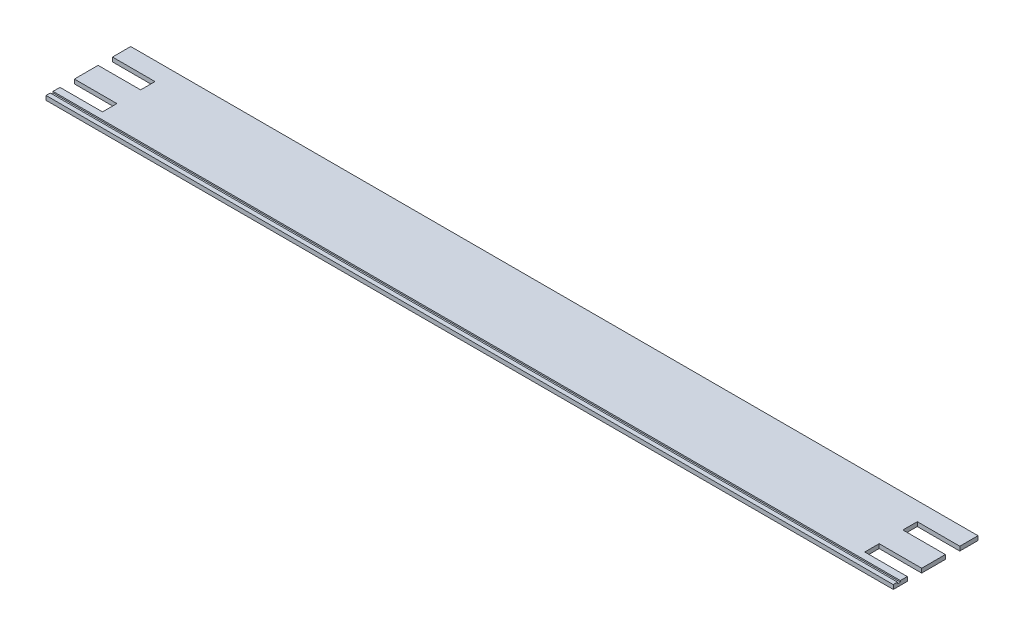
ISO-10303-21;
HEADER;
FILE_DESCRIPTION(('STEP AP214'),'2;1');
FILE_NAME('part.step','',(''),(''),'','','');
FILE_SCHEMA(('AUTOMOTIVE_DESIGN { 1 0 10303 214 1 1 1 1 }'));
ENDSEC;
DATA;
#1=APPLICATION_CONTEXT('core data for automotive mechanical design processes');
#2=APPLICATION_PROTOCOL_DEFINITION('international standard','automotive_design',2000,#1);
#3=PRODUCT_CONTEXT('',#1,'mechanical');
#4=PRODUCT('Part','Part','',(#3));
#5=PRODUCT_RELATED_PRODUCT_CATEGORY('part','',(#4));
#6=PRODUCT_DEFINITION_FORMATION('','',#4);
#7=PRODUCT_DEFINITION_CONTEXT('part definition',#1,'design');
#8=PRODUCT_DEFINITION('design','',#6,#7);
#9=PRODUCT_DEFINITION_SHAPE('','',#8);
#10=(LENGTH_UNIT() NAMED_UNIT(*) SI_UNIT(.MILLI.,.METRE.));
#11=(NAMED_UNIT(*) PLANE_ANGLE_UNIT() SI_UNIT($,.RADIAN.));
#12=(NAMED_UNIT(*) SI_UNIT($,.STERADIAN.) SOLID_ANGLE_UNIT());
#13=UNCERTAINTY_MEASURE_WITH_UNIT(LENGTH_MEASURE(1.E-05),#10,'distance_accuracy_value','');
#14=(GEOMETRIC_REPRESENTATION_CONTEXT(3) GLOBAL_UNCERTAINTY_ASSIGNED_CONTEXT((#13)) GLOBAL_UNIT_ASSIGNED_CONTEXT((#10,
#11,#12)) REPRESENTATION_CONTEXT('',''));
#15=CARTESIAN_POINT('',(0.,0.,0.));
#16=DIRECTION('',(0.,0.,1.));
#17=DIRECTION('',(1.,0.,0.));
#18=AXIS2_PLACEMENT_3D('',#15,#16,#17);
#19=CARTESIAN_POINT('',(-300.,-47.,3.));
#20=DIRECTION('',(0.,-1.,0.));
#21=DIRECTION('',(0.,0.,-1.));
#22=AXIS2_PLACEMENT_3D('',#19,#20,#21);
#23=PLANE('',#22);
#24=DIRECTION('',(0.,0.,1.));
#25=VECTOR('',#24,1.);
#26=CARTESIAN_POINT('',(300.,-47.,3.));
#27=LINE('',#26,#25);
#28=CARTESIAN_POINT('',(300.,-47.0000000000001,57.));
#29=VERTEX_POINT('',#28);
#30=CARTESIAN_POINT('',(300.,-47.,60.));
#31=VERTEX_POINT('',#30);
#32=EDGE_CURVE('E339',#29,#31,#27,.T.);
#33=ORIENTED_EDGE('',*,*,#32,.F.);
#34=DIRECTION('',(-1.,0.,0.));
#35=VECTOR('',#34,1.);
#36=CARTESIAN_POINT('',(350.,-47.0000000000001,57.));
#37=LINE('',#36,#35);
#38=CARTESIAN_POINT('',(-300.,-47.0000000000001,57.));
#39=VERTEX_POINT('',#38);
#40=EDGE_CURVE('E287',#29,#39,#37,.T.);
#41=ORIENTED_EDGE('',*,*,#40,.T.);
#42=DIRECTION('',(0.,0.,1.));
#43=VECTOR('',#42,1.);
#44=CARTESIAN_POINT('',(-300.,-47.,3.));
#45=LINE('',#44,#43);
#46=CARTESIAN_POINT('',(-300.,-47.,60.));
#47=VERTEX_POINT('',#46);
#48=EDGE_CURVE('E348',#39,#47,#45,.T.);
#49=ORIENTED_EDGE('',*,*,#48,.T.);
#50=DIRECTION('',(1.,0.,0.));
#51=VECTOR('',#50,1.);
#52=CARTESIAN_POINT('',(-300.,-47.,60.));
#53=LINE('',#52,#51);
#54=EDGE_CURVE('E319',#47,#31,#53,.T.);
#55=ORIENTED_EDGE('',*,*,#54,.T.);
#56=EDGE_LOOP('',(#33,#41,#49,#55));
#57=FACE_BOUND('',#56,.T.);
#58=ADVANCED_FACE('F32',(#57),#23,.F.);
#59=CARTESIAN_POINT('',(-300.,0.,0.));
#60=DIRECTION('',(0.,0.,1.));
#61=DIRECTION('',(1.,0.,0.));
#62=AXIS2_PLACEMENT_3D('',#59,#60,#61);
#63=PLANE('',#62);
#64=DIRECTION('',(0.,-1.,0.));
#65=VECTOR('',#64,1.);
#66=CARTESIAN_POINT('',(-300.,0.,0.));
#67=LINE('',#66,#65);
#68=CARTESIAN_POINT('',(-300.,-47.,0.));
#69=VERTEX_POINT('',#68);
#70=CARTESIAN_POINT('',(-300.,-50.,0.));
#71=VERTEX_POINT('',#70);
#72=EDGE_CURVE('E332',#69,#71,#67,.T.);
#73=ORIENTED_EDGE('',*,*,#72,.F.);
#74=DIRECTION('',(-1.,0.,0.));
#75=VECTOR('',#74,1.);
#76=CARTESIAN_POINT('',(-300.,-47.,0.));
#77=LINE('',#76,#75);
#78=CARTESIAN_POINT('',(300.,-47.,0.));
#79=VERTEX_POINT('',#78);
#80=EDGE_CURVE('E326',#79,#69,#77,.T.);
#81=ORIENTED_EDGE('',*,*,#80,.F.);
#82=DIRECTION('',(0.,-1.,0.));
#83=VECTOR('',#82,1.);
#84=CARTESIAN_POINT('',(300.,3.43367945760358E-13,0.));
#85=LINE('',#84,#83);
#86=CARTESIAN_POINT('',(300.,-50.,0.));
#87=VERTEX_POINT('',#86);
#88=EDGE_CURVE('E329',#79,#87,#85,.T.);
#89=ORIENTED_EDGE('',*,*,#88,.T.);
#90=DIRECTION('',(1.,0.,0.));
#91=VECTOR('',#90,1.);
#92=CARTESIAN_POINT('',(-300.,-50.,0.));
#93=LINE('',#92,#91);
#94=EDGE_CURVE('E322',#71,#87,#93,.T.);
#95=ORIENTED_EDGE('',*,*,#94,.F.);
#96=EDGE_LOOP('',(#73,#81,#89,#95));
#97=FACE_BOUND('',#96,.T.);
#98=ADVANCED_FACE('F408',(#97),#63,.F.);
#99=CARTESIAN_POINT('',(-300.,0.,60.));
#100=DIRECTION('',(0.,0.,1.));
#101=DIRECTION('',(1.,0.,0.));
#102=AXIS2_PLACEMENT_3D('',#99,#100,#101);
#103=PLANE('',#102);
#104=ORIENTED_EDGE('',*,*,#54,.F.);
#105=DIRECTION('',(0.,-1.,0.));
#106=VECTOR('',#105,1.);
#107=CARTESIAN_POINT('',(-300.,0.,60.));
#108=LINE('',#107,#106);
#109=CARTESIAN_POINT('',(-300.,-50.,60.));
#110=VERTEX_POINT('',#109);
#111=EDGE_CURVE('E306',#47,#110,#108,.T.);
#112=ORIENTED_EDGE('',*,*,#111,.T.);
#113=DIRECTION('',(1.,0.,0.));
#114=VECTOR('',#113,1.);
#115=CARTESIAN_POINT('',(-300.,-50.,60.));
#116=LINE('',#115,#114);
#117=CARTESIAN_POINT('',(300.,-50.,60.));
#118=VERTEX_POINT('',#117);
#119=EDGE_CURVE('E314',#110,#118,#116,.T.);
#120=ORIENTED_EDGE('',*,*,#119,.T.);
#121=DIRECTION('',(0.,-1.,0.));
#122=VECTOR('',#121,1.);
#123=CARTESIAN_POINT('',(300.,3.43367945760358E-13,60.));
#124=LINE('',#123,#122);
#125=EDGE_CURVE('E310',#31,#118,#124,.T.);
#126=ORIENTED_EDGE('',*,*,#125,.F.);
#127=EDGE_LOOP('',(#104,#112,#120,#126));
#128=FACE_BOUND('',#127,.T.);
#129=ADVANCED_FACE('F413',(#128),#103,.T.);
#130=DIRECTION('',(1.,0.,0.));
#131=VECTOR('',#130,1.);
#132=CARTESIAN_POINT('',(-300.,-47.,12.9));
#133=LINE('',#132,#131);
#134=CARTESIAN_POINT('',(-300.,-47.,12.9));
#135=VERTEX_POINT('',#134);
#136=CARTESIAN_POINT('',(-269.9,-47.,12.9));
#137=VERTEX_POINT('',#136);
#138=EDGE_CURVE('E256',#135,#137,#133,.T.);
#139=ORIENTED_EDGE('',*,*,#138,.T.);
#140=DIRECTION('',(0.,0.,1.));
#141=VECTOR('',#140,1.);
#142=CARTESIAN_POINT('',(-269.9,-47.,3.));
#143=LINE('',#142,#141);
#144=CARTESIAN_POINT('',(-269.9,-47.,23.1));
#145=VERTEX_POINT('',#144);
#146=EDGE_CURVE('E263',#137,#145,#143,.T.);
#147=ORIENTED_EDGE('',*,*,#146,.T.);
#148=DIRECTION('',(-1.,0.,0.));
#149=VECTOR('',#148,1.);
#150=CARTESIAN_POINT('',(-300.,-47.,23.1));
#151=LINE('',#150,#149);
#152=CARTESIAN_POINT('',(-300.,-47.,23.1));
#153=VERTEX_POINT('',#152);
#154=EDGE_CURVE('E260',#145,#153,#151,.T.);
#155=ORIENTED_EDGE('',*,*,#154,.T.);
#156=CARTESIAN_POINT('',(-300.,-47.,39.9));
#157=VERTEX_POINT('',#156);
#158=EDGE_CURVE('E347',#153,#157,#45,.T.);
#159=ORIENTED_EDGE('',*,*,#158,.T.);
#160=DIRECTION('',(1.,0.,0.));
#161=VECTOR('',#160,1.);
#162=CARTESIAN_POINT('',(-300.,-47.,39.9));
#163=LINE('',#162,#161);
#164=CARTESIAN_POINT('',(-269.9,-47.,39.9));
#165=VERTEX_POINT('',#164);
#166=EDGE_CURVE('E281',#157,#165,#163,.T.);
#167=ORIENTED_EDGE('',*,*,#166,.T.);
#168=DIRECTION('',(0.,0.,1.));
#169=VECTOR('',#168,1.);
#170=CARTESIAN_POINT('',(-269.9,-47.,3.));
#171=LINE('',#170,#169);
#172=CARTESIAN_POINT('',(-269.9,-47.,50.1));
#173=VERTEX_POINT('',#172);
#174=EDGE_CURVE('E284',#165,#173,#171,.T.);
#175=ORIENTED_EDGE('',*,*,#174,.T.);
#176=DIRECTION('',(-1.,0.,0.));
#177=VECTOR('',#176,1.);
#178=CARTESIAN_POINT('',(-300.,-47.,50.1));
#179=LINE('',#178,#177);
#180=CARTESIAN_POINT('',(-300.,-47.,50.1));
#181=VERTEX_POINT('',#180);
#182=EDGE_CURVE('E275',#173,#181,#179,.T.);
#183=ORIENTED_EDGE('',*,*,#182,.T.);
#184=CARTESIAN_POINT('',(-300.,-47.0000000000001,55.));
#185=VERTEX_POINT('',#184);
#186=EDGE_CURVE('E323',#181,#185,#45,.T.);
#187=ORIENTED_EDGE('',*,*,#186,.T.);
#188=DIRECTION('',(-1.,0.,0.));
#189=VECTOR('',#188,1.);
#190=CARTESIAN_POINT('',(350.,-47.0000000000001,55.));
#191=LINE('',#190,#189);
#192=CARTESIAN_POINT('',(300.,-47.0000000000001,55.));
#193=VERTEX_POINT('',#192);
#194=EDGE_CURVE('E295',#193,#185,#191,.T.);
#195=ORIENTED_EDGE('',*,*,#194,.F.);
#196=CARTESIAN_POINT('',(300.,-47.,50.1));
#197=VERTEX_POINT('',#196);
#198=EDGE_CURVE('E344',#197,#193,#27,.T.);
#199=ORIENTED_EDGE('',*,*,#198,.F.);
#200=DIRECTION('',(-1.,0.,0.));
#201=VECTOR('',#200,1.);
#202=CARTESIAN_POINT('',(-300.,-47.,50.1));
#203=LINE('',#202,#201);
#204=CARTESIAN_POINT('',(269.9,-47.,50.1));
#205=VERTEX_POINT('',#204);
#206=EDGE_CURVE('E239',#197,#205,#203,.T.);
#207=ORIENTED_EDGE('',*,*,#206,.T.);
#208=DIRECTION('',(0.,0.,-1.));
#209=VECTOR('',#208,1.);
#210=CARTESIAN_POINT('',(269.9,-47.,3.));
#211=LINE('',#210,#209);
#212=CARTESIAN_POINT('',(269.9,-47.,39.9));
#213=VERTEX_POINT('',#212);
#214=EDGE_CURVE('E242',#205,#213,#211,.T.);
#215=ORIENTED_EDGE('',*,*,#214,.T.);
#216=DIRECTION('',(1.,0.,0.));
#217=VECTOR('',#216,1.);
#218=CARTESIAN_POINT('',(-300.,-47.,39.9));
#219=LINE('',#218,#217);
#220=CARTESIAN_POINT('',(300.,-47.,39.9));
#221=VERTEX_POINT('',#220);
#222=EDGE_CURVE('E235',#213,#221,#219,.T.);
#223=ORIENTED_EDGE('',*,*,#222,.T.);
#224=CARTESIAN_POINT('',(300.,-47.,23.1));
#225=VERTEX_POINT('',#224);
#226=EDGE_CURVE('E338',#225,#221,#27,.T.);
#227=ORIENTED_EDGE('',*,*,#226,.F.);
#228=DIRECTION('',(-1.,0.,0.));
#229=VECTOR('',#228,1.);
#230=CARTESIAN_POINT('',(-300.,-47.,23.1));
#231=LINE('',#230,#229);
#232=CARTESIAN_POINT('',(269.9,-47.,23.1));
#233=VERTEX_POINT('',#232);
#234=EDGE_CURVE('E222',#225,#233,#231,.T.);
#235=ORIENTED_EDGE('',*,*,#234,.T.);
#236=DIRECTION('',(0.,0.,-1.));
#237=VECTOR('',#236,1.);
#238=CARTESIAN_POINT('',(269.9,-47.,3.));
#239=LINE('',#238,#237);
#240=CARTESIAN_POINT('',(269.9,-47.,12.9));
#241=VERTEX_POINT('',#240);
#242=EDGE_CURVE('E201',#233,#241,#239,.T.);
#243=ORIENTED_EDGE('',*,*,#242,.T.);
#244=DIRECTION('',(1.,0.,0.));
#245=VECTOR('',#244,1.);
#246=CARTESIAN_POINT('',(-300.,-47.,12.9));
#247=LINE('',#246,#245);
#248=CARTESIAN_POINT('',(300.,-47.,12.9));
#249=VERTEX_POINT('',#248);
#250=EDGE_CURVE('E218',#241,#249,#247,.T.);
#251=ORIENTED_EDGE('',*,*,#250,.T.);
#252=EDGE_CURVE('E305',#79,#249,#27,.T.);
#253=ORIENTED_EDGE('',*,*,#252,.F.);
#254=ORIENTED_EDGE('',*,*,#80,.T.);
#255=EDGE_CURVE('E317',#69,#135,#45,.T.);
#256=ORIENTED_EDGE('',*,*,#255,.T.);
#257=EDGE_LOOP('',(#139,#147,#155,#159,#167,#175,#183,#187,#195,#199,#207,#215,#223,#227,#235,
#243,#251,#253,#254,#256));
#258=FACE_BOUND('',#257,.T.);
#259=ADVANCED_FACE('F34',(#258),#23,.F.);
#260=CARTESIAN_POINT('',(-300.,-50.,60.));
#261=DIRECTION('',(0.,1.,0.));
#262=DIRECTION('',(0.,0.,1.));
#263=AXIS2_PLACEMENT_3D('',#260,#261,#262);
#264=PLANE('',#263);
#265=DIRECTION('',(1.,0.,0.));
#266=VECTOR('',#265,1.);
#267=CARTESIAN_POINT('',(269.9,-50.,12.9));
#268=LINE('',#267,#266);
#269=CARTESIAN_POINT('',(269.9,-50.,12.9));
#270=VERTEX_POINT('',#269);
#271=CARTESIAN_POINT('',(300.,-50.,12.9));
#272=VERTEX_POINT('',#271);
#273=EDGE_CURVE('E47',#270,#272,#268,.T.);
#274=ORIENTED_EDGE('',*,*,#273,.F.);
#275=DIRECTION('',(0.,0.,-1.));
#276=VECTOR('',#275,1.);
#277=CARTESIAN_POINT('',(269.9,-50.,23.1));
#278=LINE('',#277,#276);
#279=CARTESIAN_POINT('',(269.9,-50.,23.1));
#280=VERTEX_POINT('',#279);
#281=EDGE_CURVE('E199',#280,#270,#278,.T.);
#282=ORIENTED_EDGE('',*,*,#281,.F.);
#283=DIRECTION('',(-1.,0.,0.));
#284=VECTOR('',#283,1.);
#285=CARTESIAN_POINT('',(269.9,-50.,23.1));
#286=LINE('',#285,#284);
#287=CARTESIAN_POINT('',(300.,-50.,23.1));
#288=VERTEX_POINT('',#287);
#289=EDGE_CURVE('E207',#288,#280,#286,.T.);
#290=ORIENTED_EDGE('',*,*,#289,.F.);
#291=DIRECTION('',(0.,0.,-1.));
#292=VECTOR('',#291,1.);
#293=CARTESIAN_POINT('',(300.,-50.,60.));
#294=LINE('',#293,#292);
#295=CARTESIAN_POINT('',(300.,-50.,39.9));
#296=VERTEX_POINT('',#295);
#297=EDGE_CURVE('E343',#296,#288,#294,.T.);
#298=ORIENTED_EDGE('',*,*,#297,.F.);
#299=DIRECTION('',(1.,0.,0.));
#300=VECTOR('',#299,1.);
#301=CARTESIAN_POINT('',(269.9,-50.,39.9));
#302=LINE('',#301,#300);
#303=CARTESIAN_POINT('',(269.9,-50.,39.9));
#304=VERTEX_POINT('',#303);
#305=EDGE_CURVE('E55',#304,#296,#302,.T.);
#306=ORIENTED_EDGE('',*,*,#305,.F.);
#307=DIRECTION('',(0.,0.,-1.));
#308=VECTOR('',#307,1.);
#309=CARTESIAN_POINT('',(269.9,-50.,50.1));
#310=LINE('',#309,#308);
#311=CARTESIAN_POINT('',(269.9,-50.,50.1));
#312=VERTEX_POINT('',#311);
#313=EDGE_CURVE('E228',#312,#304,#310,.T.);
#314=ORIENTED_EDGE('',*,*,#313,.F.);
#315=DIRECTION('',(-1.,0.,0.));
#316=VECTOR('',#315,1.);
#317=CARTESIAN_POINT('',(269.9,-50.,50.1));
#318=LINE('',#317,#316);
#319=CARTESIAN_POINT('',(300.,-50.,50.1));
#320=VERTEX_POINT('',#319);
#321=EDGE_CURVE('E225',#320,#312,#318,.T.);
#322=ORIENTED_EDGE('',*,*,#321,.F.);
#323=EDGE_CURVE('E340',#118,#320,#294,.T.);
#324=ORIENTED_EDGE('',*,*,#323,.F.);
#325=ORIENTED_EDGE('',*,*,#119,.F.);
#326=DIRECTION('',(0.,0.,-1.));
#327=VECTOR('',#326,1.);
#328=CARTESIAN_POINT('',(-300.,-50.,60.));
#329=LINE('',#328,#327);
#330=CARTESIAN_POINT('',(-300.,-50.,50.1));
#331=VERTEX_POINT('',#330);
#332=EDGE_CURVE('E309',#110,#331,#329,.T.);
#333=ORIENTED_EDGE('',*,*,#332,.T.);
#334=DIRECTION('',(1.,0.,0.));
#335=VECTOR('',#334,1.);
#336=CARTESIAN_POINT('',(-300.,-50.,50.1));
#337=LINE('',#336,#335);
#338=CARTESIAN_POINT('',(-269.9,-50.,50.1));
#339=VERTEX_POINT('',#338);
#340=EDGE_CURVE('E270',#331,#339,#337,.T.);
#341=ORIENTED_EDGE('',*,*,#340,.T.);
#342=DIRECTION('',(0.,0.,-1.));
#343=VECTOR('',#342,1.);
#344=CARTESIAN_POINT('',(-269.9,-50.,60.));
#345=LINE('',#344,#343);
#346=CARTESIAN_POINT('',(-269.9,-50.,39.9));
#347=VERTEX_POINT('',#346);
#348=EDGE_CURVE('E364',#339,#347,#345,.T.);
#349=ORIENTED_EDGE('',*,*,#348,.T.);
#350=DIRECTION('',(-1.,0.,0.));
#351=VECTOR('',#350,1.);
#352=CARTESIAN_POINT('',(-300.,-50.,39.9));
#353=LINE('',#352,#351);
#354=CARTESIAN_POINT('',(-300.,-50.,39.9));
#355=VERTEX_POINT('',#354);
#356=EDGE_CURVE('E278',#347,#355,#353,.T.);
#357=ORIENTED_EDGE('',*,*,#356,.T.);
#358=CARTESIAN_POINT('',(-300.,-50.,23.1));
#359=VERTEX_POINT('',#358);
#360=EDGE_CURVE('E351',#355,#359,#329,.T.);
#361=ORIENTED_EDGE('',*,*,#360,.T.);
#362=DIRECTION('',(-1.,0.,0.));
#363=VECTOR('',#362,1.);
#364=CARTESIAN_POINT('',(-300.1,-50.,23.1));
#365=LINE('',#364,#363);
#366=CARTESIAN_POINT('',(-269.9,-50.,23.1));
#367=VERTEX_POINT('',#366);
#368=EDGE_CURVE('E245',#367,#359,#365,.T.);
#369=ORIENTED_EDGE('',*,*,#368,.F.);
#370=DIRECTION('',(0.,0.,1.));
#371=VECTOR('',#370,1.);
#372=CARTESIAN_POINT('',(-269.9,-50.,23.1));
#373=LINE('',#372,#371);
#374=CARTESIAN_POINT('',(-269.9,-50.,12.9));
#375=VERTEX_POINT('',#374);
#376=EDGE_CURVE('E250',#375,#367,#373,.T.);
#377=ORIENTED_EDGE('',*,*,#376,.F.);
#378=DIRECTION('',(1.,0.,0.));
#379=VECTOR('',#378,1.);
#380=CARTESIAN_POINT('',(-300.1,-50.,12.9));
#381=LINE('',#380,#379);
#382=CARTESIAN_POINT('',(-300.,-50.,12.9));
#383=VERTEX_POINT('',#382);
#384=EDGE_CURVE('E247',#383,#375,#381,.T.);
#385=ORIENTED_EDGE('',*,*,#384,.F.);
#386=EDGE_CURVE('E318',#383,#71,#329,.T.);
#387=ORIENTED_EDGE('',*,*,#386,.T.);
#388=ORIENTED_EDGE('',*,*,#94,.T.);
#389=EDGE_CURVE('E313',#272,#87,#294,.T.);
#390=ORIENTED_EDGE('',*,*,#389,.F.);
#391=EDGE_LOOP('',(#274,#282,#290,#298,#306,#314,#322,#324,#325,#333,#341,#349,#357,#361,#369,
#377,#385,#387,#388,#390));
#392=FACE_BOUND('',#391,.T.);
#393=ADVANCED_FACE('F213',(#392),#264,.F.);
#394=CARTESIAN_POINT('',(-300.,0.,0.));
#395=DIRECTION('',(-1.,0.,0.));
#396=DIRECTION('',(0.,0.,1.));
#397=AXIS2_PLACEMENT_3D('',#394,#395,#396);
#398=PLANE('',#397);
#399=DIRECTION('',(0.,1.,0.));
#400=VECTOR('',#399,1.);
#401=CARTESIAN_POINT('',(-300.,0.,23.1));
#402=LINE('',#401,#400);
#403=EDGE_CURVE('E369',#359,#153,#402,.T.);
#404=ORIENTED_EDGE('',*,*,#403,.F.);
#405=ORIENTED_EDGE('',*,*,#360,.F.);
#406=DIRECTION('',(0.,-1.,0.));
#407=VECTOR('',#406,1.);
#408=CARTESIAN_POINT('',(-300.,0.,39.9));
#409=LINE('',#408,#407);
#410=EDGE_CURVE('E362',#157,#355,#409,.T.);
#411=ORIENTED_EDGE('',*,*,#410,.F.);
#412=ORIENTED_EDGE('',*,*,#158,.F.);
#413=EDGE_LOOP('',(#404,#405,#411,#412));
#414=FACE_BOUND('',#413,.T.);
#415=ADVANCED_FACE('F436',(#414),#398,.T.);
#416=DIRECTION('',(0.,1.,0.));
#417=VECTOR('',#416,1.);
#418=CARTESIAN_POINT('',(-300.,0.,50.1));
#419=LINE('',#418,#417);
#420=EDGE_CURVE('E360',#331,#181,#419,.T.);
#421=ORIENTED_EDGE('',*,*,#420,.F.);
#422=ORIENTED_EDGE('',*,*,#332,.F.);
#423=ORIENTED_EDGE('',*,*,#111,.F.);
#424=ORIENTED_EDGE('',*,*,#48,.F.);
#425=DIRECTION('',(0.,1.,0.));
#426=VECTOR('',#425,1.);
#427=CARTESIAN_POINT('',(-300.,0.,57.));
#428=LINE('',#427,#426);
#429=CARTESIAN_POINT('',(-300.,-48.0000000000001,57.));
#430=VERTEX_POINT('',#429);
#431=EDGE_CURVE('E303',#430,#39,#428,.T.);
#432=ORIENTED_EDGE('',*,*,#431,.F.);
#433=DIRECTION('',(0.,0.,1.));
#434=VECTOR('',#433,1.);
#435=CARTESIAN_POINT('',(-300.,-48.0000000000001,0.));
#436=LINE('',#435,#434);
#437=CARTESIAN_POINT('',(-300.,-48.0000000000001,55.));
#438=VERTEX_POINT('',#437);
#439=EDGE_CURVE('E301',#438,#430,#436,.T.);
#440=ORIENTED_EDGE('',*,*,#439,.F.);
#441=DIRECTION('',(0.,-1.,0.));
#442=VECTOR('',#441,1.);
#443=CARTESIAN_POINT('',(-300.,0.,55.));
#444=LINE('',#443,#442);
#445=EDGE_CURVE('E291',#185,#438,#444,.T.);
#446=ORIENTED_EDGE('',*,*,#445,.F.);
#447=ORIENTED_EDGE('',*,*,#186,.F.);
#448=EDGE_LOOP('',(#421,#422,#423,#424,#432,#440,#446,#447));
#449=FACE_BOUND('',#448,.T.);
#450=ADVANCED_FACE('F434',(#449),#398,.T.);
#451=DIRECTION('',(0.,-1.,0.));
#452=VECTOR('',#451,1.);
#453=CARTESIAN_POINT('',(-300.,0.,12.9));
#454=LINE('',#453,#452);
#455=EDGE_CURVE('E367',#135,#383,#454,.T.);
#456=ORIENTED_EDGE('',*,*,#455,.F.);
#457=ORIENTED_EDGE('',*,*,#255,.F.);
#458=ORIENTED_EDGE('',*,*,#72,.T.);
#459=ORIENTED_EDGE('',*,*,#386,.F.);
#460=EDGE_LOOP('',(#456,#457,#458,#459));
#461=FACE_BOUND('',#460,.T.);
#462=ADVANCED_FACE('F430',(#461),#398,.T.);
#463=CARTESIAN_POINT('',(300.,1.71683972880179E-13,0.));
#464=DIRECTION('',(-1.,0.,0.));
#465=DIRECTION('',(0.,-1.,0.));
#466=AXIS2_PLACEMENT_3D('',#463,#464,#465);
#467=PLANE('',#466);
#468=ORIENTED_EDGE('',*,*,#323,.T.);
#469=DIRECTION('',(0.,1.,0.));
#470=VECTOR('',#469,1.);
#471=CARTESIAN_POINT('',(300.,1.71683972880179E-13,50.1));
#472=LINE('',#471,#470);
#473=EDGE_CURVE('E373',#320,#197,#472,.T.);
#474=ORIENTED_EDGE('',*,*,#473,.T.);
#475=ORIENTED_EDGE('',*,*,#198,.T.);
#476=DIRECTION('',(0.,-1.,0.));
#477=VECTOR('',#476,1.);
#478=CARTESIAN_POINT('',(300.,1.71683972880179E-13,55.));
#479=LINE('',#478,#477);
#480=CARTESIAN_POINT('',(300.,-48.0000000000001,55.));
#481=VERTEX_POINT('',#480);
#482=EDGE_CURVE('E335',#193,#481,#479,.T.);
#483=ORIENTED_EDGE('',*,*,#482,.T.);
#484=DIRECTION('',(0.,0.,1.));
#485=VECTOR('',#484,1.);
#486=CARTESIAN_POINT('',(300.,-48.0000000000001,0.));
#487=LINE('',#486,#485);
#488=CARTESIAN_POINT('',(300.,-48.0000000000001,57.));
#489=VERTEX_POINT('',#488);
#490=EDGE_CURVE('E354',#481,#489,#487,.T.);
#491=ORIENTED_EDGE('',*,*,#490,.T.);
#492=DIRECTION('',(0.,1.,0.));
#493=VECTOR('',#492,1.);
#494=CARTESIAN_POINT('',(300.,1.71683972880179E-13,57.));
#495=LINE('',#494,#493);
#496=EDGE_CURVE('E357',#489,#29,#495,.T.);
#497=ORIENTED_EDGE('',*,*,#496,.T.);
#498=ORIENTED_EDGE('',*,*,#32,.T.);
#499=ORIENTED_EDGE('',*,*,#125,.T.);
#500=EDGE_LOOP('',(#468,#474,#475,#483,#491,#497,#498,#499));
#501=FACE_BOUND('',#500,.T.);
#502=ADVANCED_FACE('F392',(#501),#467,.F.);
#503=ORIENTED_EDGE('',*,*,#297,.T.);
#504=DIRECTION('',(0.,1.,0.));
#505=VECTOR('',#504,1.);
#506=CARTESIAN_POINT('',(300.,1.71683972880179E-13,23.1));
#507=LINE('',#506,#505);
#508=EDGE_CURVE('E11',#288,#225,#507,.T.);
#509=ORIENTED_EDGE('',*,*,#508,.T.);
#510=ORIENTED_EDGE('',*,*,#226,.T.);
#511=DIRECTION('',(0.,-1.,0.));
#512=VECTOR('',#511,1.);
#513=CARTESIAN_POINT('',(300.,1.71683972880179E-13,39.9));
#514=LINE('',#513,#512);
#515=EDGE_CURVE('E371',#221,#296,#514,.T.);
#516=ORIENTED_EDGE('',*,*,#515,.T.);
#517=EDGE_LOOP('',(#503,#509,#510,#516));
#518=FACE_BOUND('',#517,.T.);
#519=ADVANCED_FACE('F380',(#518),#467,.F.);
#520=ORIENTED_EDGE('',*,*,#252,.T.);
#521=DIRECTION('',(0.,-1.,0.));
#522=VECTOR('',#521,1.);
#523=CARTESIAN_POINT('',(300.,1.71683972880179E-13,12.9));
#524=LINE('',#523,#522);
#525=EDGE_CURVE('E40',#249,#272,#524,.T.);
#526=ORIENTED_EDGE('',*,*,#525,.T.);
#527=ORIENTED_EDGE('',*,*,#389,.T.);
#528=ORIENTED_EDGE('',*,*,#88,.F.);
#529=EDGE_LOOP('',(#520,#526,#527,#528));
#530=FACE_BOUND('',#529,.T.);
#531=ADVANCED_FACE('F376',(#530),#467,.F.);
#532=CARTESIAN_POINT('',(350.,-47.0000000000001,57.));
#533=DIRECTION('',(0.,0.,1.));
#534=DIRECTION('',(1.,0.,0.));
#535=AXIS2_PLACEMENT_3D('',#532,#533,#534);
#536=PLANE('',#535);
#537=ORIENTED_EDGE('',*,*,#431,.T.);
#538=ORIENTED_EDGE('',*,*,#40,.F.);
#539=ORIENTED_EDGE('',*,*,#496,.F.);
#540=DIRECTION('',(-1.,0.,0.));
#541=VECTOR('',#540,1.);
#542=CARTESIAN_POINT('',(350.,-48.0000000000001,57.));
#543=LINE('',#542,#541);
#544=EDGE_CURVE('E288',#489,#430,#543,.T.);
#545=ORIENTED_EDGE('',*,*,#544,.T.);
#546=EDGE_LOOP('',(#537,#538,#539,#545));
#547=FACE_BOUND('',#546,.T.);
#548=ADVANCED_FACE('F416',(#547),#536,.F.);
#549=CARTESIAN_POINT('',(350.,-48.0000000000001,57.));
#550=DIRECTION('',(0.,-1.,0.));
#551=DIRECTION('',(0.,0.,-1.));
#552=AXIS2_PLACEMENT_3D('',#549,#550,#551);
#553=PLANE('',#552);
#554=ORIENTED_EDGE('',*,*,#439,.T.);
#555=ORIENTED_EDGE('',*,*,#544,.F.);
#556=ORIENTED_EDGE('',*,*,#490,.F.);
#557=DIRECTION('',(-1.,0.,0.));
#558=VECTOR('',#557,1.);
#559=CARTESIAN_POINT('',(350.,-48.0000000000001,55.));
#560=LINE('',#559,#558);
#561=EDGE_CURVE('E292',#481,#438,#560,.T.);
#562=ORIENTED_EDGE('',*,*,#561,.T.);
#563=EDGE_LOOP('',(#554,#555,#556,#562));
#564=FACE_BOUND('',#563,.T.);
#565=ADVANCED_FACE('F425',(#564),#553,.F.);
#566=CARTESIAN_POINT('',(350.,-47.0000000000001,55.));
#567=DIRECTION('',(0.,0.,-1.));
#568=DIRECTION('',(-1.,0.,0.));
#569=AXIS2_PLACEMENT_3D('',#566,#567,#568);
#570=PLANE('',#569);
#571=ORIENTED_EDGE('',*,*,#445,.T.);
#572=ORIENTED_EDGE('',*,*,#561,.F.);
#573=ORIENTED_EDGE('',*,*,#482,.F.);
#574=ORIENTED_EDGE('',*,*,#194,.T.);
#575=EDGE_LOOP('',(#571,#572,#573,#574));
#576=FACE_BOUND('',#575,.T.);
#577=ADVANCED_FACE('F550',(#576),#570,.F.);
#578=CARTESIAN_POINT('',(-269.9,51.,50.1));
#579=DIRECTION('',(1.,0.,0.));
#580=DIRECTION('',(0.,0.,-1.));
#581=AXIS2_PLACEMENT_3D('',#578,#579,#580);
#582=PLANE('',#581);
#583=DIRECTION('',(0.,-1.,0.));
#584=VECTOR('',#583,1.);
#585=CARTESIAN_POINT('',(-269.9,51.,39.9));
#586=LINE('',#585,#584);
#587=EDGE_CURVE('E266',#165,#347,#586,.T.);
#588=ORIENTED_EDGE('',*,*,#587,.T.);
#589=ORIENTED_EDGE('',*,*,#348,.F.);
#590=DIRECTION('',(0.,-1.,0.));
#591=VECTOR('',#590,1.);
#592=CARTESIAN_POINT('',(-269.9,51.,50.1));
#593=LINE('',#592,#591);
#594=EDGE_CURVE('E267',#173,#339,#593,.T.);
#595=ORIENTED_EDGE('',*,*,#594,.F.);
#596=ORIENTED_EDGE('',*,*,#174,.F.);
#597=EDGE_LOOP('',(#588,#589,#595,#596));
#598=FACE_BOUND('',#597,.T.);
#599=ADVANCED_FACE('F540',(#598),#582,.F.);
#600=CARTESIAN_POINT('',(-300.1,51.,39.9));
#601=DIRECTION('',(0.,0.,-1.));
#602=DIRECTION('',(-1.,0.,0.));
#603=AXIS2_PLACEMENT_3D('',#600,#601,#602);
#604=PLANE('',#603);
#605=ORIENTED_EDGE('',*,*,#410,.T.);
#606=ORIENTED_EDGE('',*,*,#356,.F.);
#607=ORIENTED_EDGE('',*,*,#587,.F.);
#608=ORIENTED_EDGE('',*,*,#166,.F.);
#609=EDGE_LOOP('',(#605,#606,#607,#608));
#610=FACE_BOUND('',#609,.T.);
#611=ADVANCED_FACE('F530',(#610),#604,.F.);
#612=CARTESIAN_POINT('',(-300.1,51.,50.1));
#613=DIRECTION('',(0.,0.,1.));
#614=DIRECTION('',(1.,0.,0.));
#615=AXIS2_PLACEMENT_3D('',#612,#613,#614);
#616=PLANE('',#615);
#617=ORIENTED_EDGE('',*,*,#594,.T.);
#618=ORIENTED_EDGE('',*,*,#340,.F.);
#619=ORIENTED_EDGE('',*,*,#420,.T.);
#620=ORIENTED_EDGE('',*,*,#182,.F.);
#621=EDGE_LOOP('',(#617,#618,#619,#620));
#622=FACE_BOUND('',#621,.T.);
#623=ADVANCED_FACE('F520',(#622),#616,.F.);
#624=CARTESIAN_POINT('',(-269.9,51.,23.1));
#625=DIRECTION('',(1.,0.,0.));
#626=DIRECTION('',(0.,0.,-1.));
#627=AXIS2_PLACEMENT_3D('',#624,#625,#626);
#628=PLANE('',#627);
#629=DIRECTION('',(0.,-1.,0.));
#630=VECTOR('',#629,1.);
#631=CARTESIAN_POINT('',(-269.9,51.,12.9));
#632=LINE('',#631,#630);
#633=EDGE_CURVE('E253',#137,#375,#632,.T.);
#634=ORIENTED_EDGE('',*,*,#633,.T.);
#635=ORIENTED_EDGE('',*,*,#376,.T.);
#636=DIRECTION('',(0.,-1.,0.));
#637=VECTOR('',#636,1.);
#638=CARTESIAN_POINT('',(-269.9,51.,23.1));
#639=LINE('',#638,#637);
#640=EDGE_CURVE('E254',#145,#367,#639,.T.);
#641=ORIENTED_EDGE('',*,*,#640,.F.);
#642=ORIENTED_EDGE('',*,*,#146,.F.);
#643=EDGE_LOOP('',(#634,#635,#641,#642));
#644=FACE_BOUND('',#643,.T.);
#645=ADVANCED_FACE('F511',(#644),#628,.F.);
#646=CARTESIAN_POINT('',(-300.1,51.,23.1));
#647=DIRECTION('',(0.,0.,1.));
#648=DIRECTION('',(1.,0.,0.));
#649=AXIS2_PLACEMENT_3D('',#646,#647,#648);
#650=PLANE('',#649);
#651=ORIENTED_EDGE('',*,*,#640,.T.);
#652=ORIENTED_EDGE('',*,*,#368,.T.);
#653=ORIENTED_EDGE('',*,*,#403,.T.);
#654=ORIENTED_EDGE('',*,*,#154,.F.);
#655=EDGE_LOOP('',(#651,#652,#653,#654));
#656=FACE_BOUND('',#655,.T.);
#657=ADVANCED_FACE('F501',(#656),#650,.F.);
#658=CARTESIAN_POINT('',(-300.1,51.,12.9));
#659=DIRECTION('',(0.,0.,-1.));
#660=DIRECTION('',(-1.,0.,0.));
#661=AXIS2_PLACEMENT_3D('',#658,#659,#660);
#662=PLANE('',#661);
#663=ORIENTED_EDGE('',*,*,#455,.T.);
#664=ORIENTED_EDGE('',*,*,#384,.T.);
#665=ORIENTED_EDGE('',*,*,#633,.F.);
#666=ORIENTED_EDGE('',*,*,#138,.F.);
#667=EDGE_LOOP('',(#663,#664,#665,#666));
#668=FACE_BOUND('',#667,.T.);
#669=ADVANCED_FACE('F493',(#668),#662,.F.);
#670=CARTESIAN_POINT('',(269.9,51.,50.1));
#671=DIRECTION('',(-1.,0.,0.));
#672=DIRECTION('',(0.,0.,1.));
#673=AXIS2_PLACEMENT_3D('',#670,#671,#672);
#674=PLANE('',#673);
#675=DIRECTION('',(0.,-1.,0.));
#676=VECTOR('',#675,1.);
#677=CARTESIAN_POINT('',(269.9,51.,50.1));
#678=LINE('',#677,#676);
#679=EDGE_CURVE('E232',#205,#312,#678,.T.);
#680=ORIENTED_EDGE('',*,*,#679,.T.);
#681=ORIENTED_EDGE('',*,*,#313,.T.);
#682=DIRECTION('',(0.,-1.,0.));
#683=VECTOR('',#682,1.);
#684=CARTESIAN_POINT('',(269.9,51.,39.9));
#685=LINE('',#684,#683);
#686=EDGE_CURVE('E233',#213,#304,#685,.T.);
#687=ORIENTED_EDGE('',*,*,#686,.F.);
#688=ORIENTED_EDGE('',*,*,#214,.F.);
#689=EDGE_LOOP('',(#680,#681,#687,#688));
#690=FACE_BOUND('',#689,.T.);
#691=ADVANCED_FACE('F386',(#690),#674,.F.);
#692=CARTESIAN_POINT('',(269.9,51.,50.1));
#693=DIRECTION('',(0.,0.,1.));
#694=DIRECTION('',(1.,0.,0.));
#695=AXIS2_PLACEMENT_3D('',#692,#693,#694);
#696=PLANE('',#695);
#697=ORIENTED_EDGE('',*,*,#473,.F.);
#698=ORIENTED_EDGE('',*,*,#321,.T.);
#699=ORIENTED_EDGE('',*,*,#679,.F.);
#700=ORIENTED_EDGE('',*,*,#206,.F.);
#701=EDGE_LOOP('',(#697,#698,#699,#700));
#702=FACE_BOUND('',#701,.T.);
#703=ADVANCED_FACE('F389',(#702),#696,.F.);
#704=CARTESIAN_POINT('',(269.9,51.,39.9));
#705=DIRECTION('',(0.,0.,-1.));
#706=DIRECTION('',(-1.,0.,0.));
#707=AXIS2_PLACEMENT_3D('',#704,#705,#706);
#708=PLANE('',#707);
#709=ORIENTED_EDGE('',*,*,#686,.T.);
#710=ORIENTED_EDGE('',*,*,#305,.T.);
#711=ORIENTED_EDGE('',*,*,#515,.F.);
#712=ORIENTED_EDGE('',*,*,#222,.F.);
#713=EDGE_LOOP('',(#709,#710,#711,#712));
#714=FACE_BOUND('',#713,.T.);
#715=ADVANCED_FACE('F396',(#714),#708,.F.);
#716=CARTESIAN_POINT('',(269.9,51.,23.1));
#717=DIRECTION('',(-1.,0.,0.));
#718=DIRECTION('',(0.,0.,1.));
#719=AXIS2_PLACEMENT_3D('',#716,#717,#718);
#720=PLANE('',#719);
#721=DIRECTION('',(0.,-1.,0.));
#722=VECTOR('',#721,1.);
#723=CARTESIAN_POINT('',(269.9,51.,23.1));
#724=LINE('',#723,#722);
#725=EDGE_CURVE('E194',#233,#280,#724,.T.);
#726=ORIENTED_EDGE('',*,*,#725,.T.);
#727=ORIENTED_EDGE('',*,*,#281,.T.);
#728=DIRECTION('',(0.,-1.,0.));
#729=VECTOR('',#728,1.);
#730=CARTESIAN_POINT('',(269.9,51.,12.9));
#731=LINE('',#730,#729);
#732=EDGE_CURVE('E204',#241,#270,#731,.T.);
#733=ORIENTED_EDGE('',*,*,#732,.F.);
#734=ORIENTED_EDGE('',*,*,#242,.F.);
#735=EDGE_LOOP('',(#726,#727,#733,#734));
#736=FACE_BOUND('',#735,.T.);
#737=ADVANCED_FACE('F196',(#736),#720,.F.);
#738=CARTESIAN_POINT('',(269.9,51.,23.1));
#739=DIRECTION('',(0.,0.,1.));
#740=DIRECTION('',(1.,0.,0.));
#741=AXIS2_PLACEMENT_3D('',#738,#739,#740);
#742=PLANE('',#741);
#743=ORIENTED_EDGE('',*,*,#508,.F.);
#744=ORIENTED_EDGE('',*,*,#289,.T.);
#745=ORIENTED_EDGE('',*,*,#725,.F.);
#746=ORIENTED_EDGE('',*,*,#234,.F.);
#747=EDGE_LOOP('',(#743,#744,#745,#746));
#748=FACE_BOUND('',#747,.T.);
#749=ADVANCED_FACE('F208',(#748),#742,.F.);
#750=CARTESIAN_POINT('',(269.9,51.,12.9));
#751=DIRECTION('',(0.,0.,-1.));
#752=DIRECTION('',(-1.,0.,0.));
#753=AXIS2_PLACEMENT_3D('',#750,#751,#752);
#754=PLANE('',#753);
#755=ORIENTED_EDGE('',*,*,#732,.T.);
#756=ORIENTED_EDGE('',*,*,#273,.T.);
#757=ORIENTED_EDGE('',*,*,#525,.F.);
#758=ORIENTED_EDGE('',*,*,#250,.F.);
#759=EDGE_LOOP('',(#755,#756,#757,#758));
#760=FACE_BOUND('',#759,.T.);
#761=ADVANCED_FACE('F459',(#760),#754,.F.);
#762=CLOSED_SHELL('',(#58,#98,#129,#259,#393,#415,#450,#462,#502,#519,#531,#548,#565,#577,#599,
#611,#623,#645,#657,#669,#691,#703,#715,#737,#749,#761));
#763=MANIFOLD_SOLID_BREP('B2',#762);
#764=ADVANCED_BREP_SHAPE_REPRESENTATION('',(#18,#763),#14);
#765=SHAPE_DEFINITION_REPRESENTATION(#9,#764);
ENDSEC;
END-ISO-10303-21;
